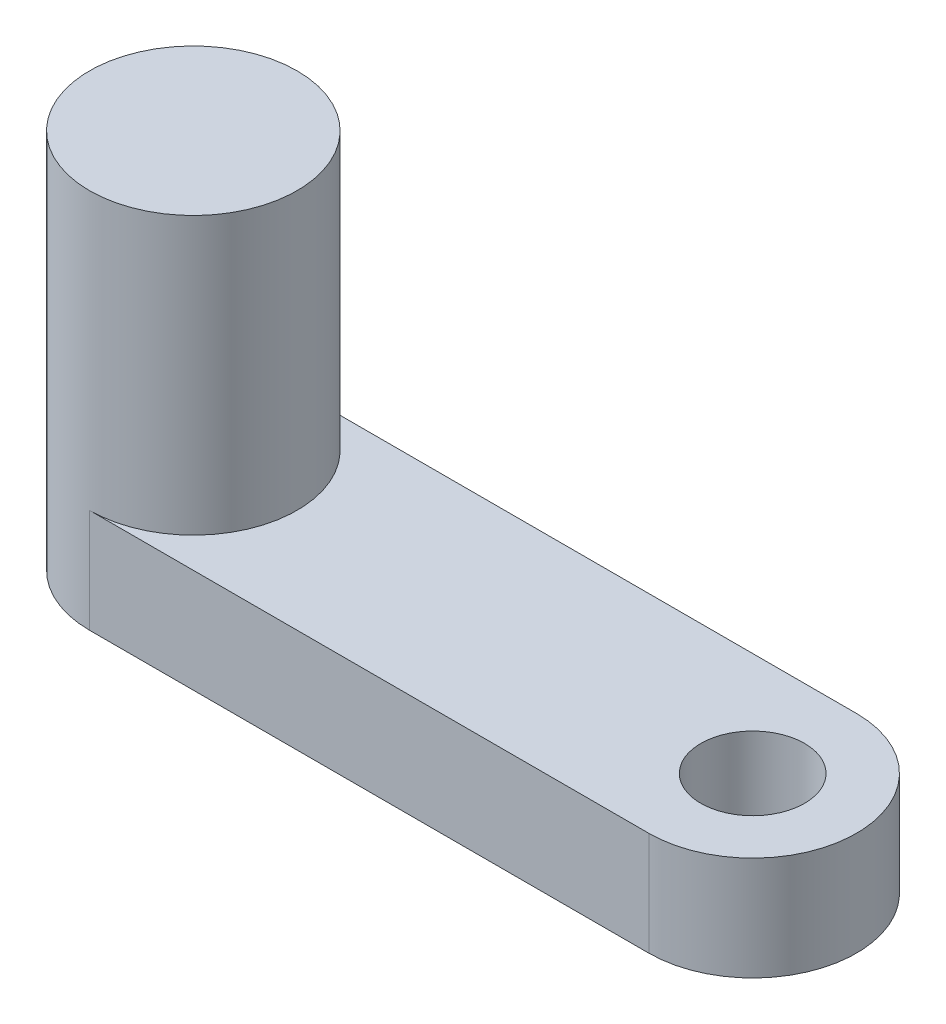
ISO-10303-21;
HEADER;
FILE_DESCRIPTION(('STEP AP214'),'2;1');
FILE_NAME('part.step','',(''),(''),'','','');
FILE_SCHEMA(('AUTOMOTIVE_DESIGN { 1 0 10303 214 1 1 1 1 }'));
ENDSEC;
DATA;
#1=APPLICATION_CONTEXT('core data for automotive mechanical design processes');
#2=APPLICATION_PROTOCOL_DEFINITION('international standard','automotive_design',2000,#1);
#3=PRODUCT_CONTEXT('',#1,'mechanical');
#4=PRODUCT('Part','Part','',(#3));
#5=PRODUCT_RELATED_PRODUCT_CATEGORY('part','',(#4));
#6=PRODUCT_DEFINITION_FORMATION('','',#4);
#7=PRODUCT_DEFINITION_CONTEXT('part definition',#1,'design');
#8=PRODUCT_DEFINITION('design','',#6,#7);
#9=PRODUCT_DEFINITION_SHAPE('','',#8);
#10=(LENGTH_UNIT() NAMED_UNIT(*) SI_UNIT(.MILLI.,.METRE.));
#11=(NAMED_UNIT(*) PLANE_ANGLE_UNIT() SI_UNIT($,.RADIAN.));
#12=(NAMED_UNIT(*) SI_UNIT($,.STERADIAN.) SOLID_ANGLE_UNIT());
#13=UNCERTAINTY_MEASURE_WITH_UNIT(LENGTH_MEASURE(1.E-05),#10,'distance_accuracy_value','');
#14=(GEOMETRIC_REPRESENTATION_CONTEXT(3) GLOBAL_UNCERTAINTY_ASSIGNED_CONTEXT((#13)) GLOBAL_UNIT_ASSIGNED_CONTEXT((#10,
#11,#12)) REPRESENTATION_CONTEXT('',''));
#15=CARTESIAN_POINT('',(0.,0.,0.));
#16=DIRECTION('',(0.,0.,1.));
#17=DIRECTION('',(1.,0.,0.));
#18=AXIS2_PLACEMENT_3D('',#15,#16,#17);
#19=CARTESIAN_POINT('',(0.,9.,0.));
#20=DIRECTION('',(0.,-1.,0.));
#21=DIRECTION('',(0.,0.,-1.));
#22=AXIS2_PLACEMENT_3D('',#19,#20,#21);
#23=CYLINDRICAL_SURFACE('',#22,3.);
#24=CARTESIAN_POINT('',(0.,1.,0.));
#25=DIRECTION('',(0.,-1.,0.));
#26=DIRECTION('',(0.,0.,-1.));
#27=AXIS2_PLACEMENT_3D('',#24,#25,#26);
#28=CIRCLE('',#27,3.);
#29=CARTESIAN_POINT('',(0.,1.,-3.));
#30=VERTEX_POINT('',#29);
#31=CARTESIAN_POINT('',(0.,1.,3.));
#32=VERTEX_POINT('',#31);
#33=EDGE_CURVE('E91',#30,#32,#28,.T.);
#34=ORIENTED_EDGE('',*,*,#33,.F.);
#35=DIRECTION('',(0.,-1.,0.));
#36=VECTOR('',#35,1.);
#37=CARTESIAN_POINT('',(0.,1.,-3.));
#38=LINE('',#37,#36);
#39=CARTESIAN_POINT('',(0.,-2.,-3.));
#40=VERTEX_POINT('',#39);
#41=EDGE_CURVE('E109',#30,#40,#38,.T.);
#42=ORIENTED_EDGE('',*,*,#41,.T.);
#43=CARTESIAN_POINT('',(0.,-2.,0.));
#44=DIRECTION('',(0.,-1.,0.));
#45=DIRECTION('',(0.,0.,-1.));
#46=AXIS2_PLACEMENT_3D('',#43,#44,#45);
#47=CIRCLE('',#46,3.);
#48=CARTESIAN_POINT('',(0.,-2.,3.));
#49=VERTEX_POINT('',#48);
#50=EDGE_CURVE('E51',#49,#40,#47,.T.);
#51=ORIENTED_EDGE('',*,*,#50,.F.);
#52=DIRECTION('',(0.,-1.,0.));
#53=VECTOR('',#52,1.);
#54=CARTESIAN_POINT('',(0.,1.,3.));
#55=LINE('',#54,#53);
#56=EDGE_CURVE('E101',#32,#49,#55,.T.);
#57=ORIENTED_EDGE('',*,*,#56,.F.);
#58=EDGE_LOOP('',(#34,#42,#51,#57));
#59=FACE_BOUND('',#58,.T.);
#60=CARTESIAN_POINT('',(0.,9.,0.));
#61=DIRECTION('',(0.,1.,0.));
#62=DIRECTION('',(0.,0.,1.));
#63=AXIS2_PLACEMENT_3D('',#60,#61,#62);
#64=CIRCLE('',#63,3.);
#65=CARTESIAN_POINT('',(0.,9.,3.));
#66=VERTEX_POINT('',#65);
#67=EDGE_CURVE('E11',#66,#66,#64,.T.);
#68=ORIENTED_EDGE('',*,*,#67,.F.);
#69=EDGE_LOOP('',(#68));
#70=FACE_BOUND('',#69,.T.);
#71=ADVANCED_FACE('F43',(#59,#70),#23,.T.);
#72=CARTESIAN_POINT('',(0.,9.,0.));
#73=DIRECTION('',(0.,1.,0.));
#74=DIRECTION('',(0.,0.,1.));
#75=AXIS2_PLACEMENT_3D('',#72,#73,#74);
#76=PLANE('',#75);
#77=ORIENTED_EDGE('',*,*,#67,.T.);
#78=EDGE_LOOP('',(#77));
#79=FACE_BOUND('',#78,.T.);
#80=ADVANCED_FACE('F160',(#79),#76,.T.);
#81=CARTESIAN_POINT('',(0.,-2.,0.));
#82=DIRECTION('',(0.,-1.,0.));
#83=DIRECTION('',(0.,0.,-1.));
#84=AXIS2_PLACEMENT_3D('',#81,#82,#83);
#85=PLANE('',#84);
#86=CARTESIAN_POINT('',(0.,-2.,0.));
#87=DIRECTION('',(0.,-1.,0.));
#88=DIRECTION('',(0.,0.,-1.));
#89=AXIS2_PLACEMENT_3D('',#86,#87,#88);
#90=CIRCLE('',#89,1.5);
#91=CARTESIAN_POINT('',(0.,-2.,-1.5));
#92=VERTEX_POINT('',#91);
#93=EDGE_CURVE('E141',#92,#92,#90,.T.);
#94=ORIENTED_EDGE('',*,*,#93,.F.);
#95=EDGE_LOOP('',(#94));
#96=FACE_BOUND('',#95,.T.);
#97=ORIENTED_EDGE('',*,*,#50,.T.);
#98=DIRECTION('',(1.,0.,0.));
#99=VECTOR('',#98,1.);
#100=CARTESIAN_POINT('',(0.,-2.,-3.));
#101=LINE('',#100,#99);
#102=CARTESIAN_POINT('',(16.1637239016283,-2.,-3.));
#103=VERTEX_POINT('',#102);
#104=EDGE_CURVE('E120',#40,#103,#101,.T.);
#105=ORIENTED_EDGE('',*,*,#104,.T.);
#106=CARTESIAN_POINT('',(16.1637239016283,-2.,0.));
#107=DIRECTION('',(0.,-1.,0.));
#108=DIRECTION('',(0.,0.,-1.));
#109=AXIS2_PLACEMENT_3D('',#106,#107,#108);
#110=CIRCLE('',#109,3.);
#111=CARTESIAN_POINT('',(16.1637239016283,-2.,3.));
#112=VERTEX_POINT('',#111);
#113=EDGE_CURVE('E126',#112,#103,#110,.F.);
#114=ORIENTED_EDGE('',*,*,#113,.F.);
#115=DIRECTION('',(1.,0.,0.));
#116=VECTOR('',#115,1.);
#117=CARTESIAN_POINT('',(0.,-2.,3.));
#118=LINE('',#117,#116);
#119=EDGE_CURVE('E58',#49,#112,#118,.T.);
#120=ORIENTED_EDGE('',*,*,#119,.F.);
#121=EDGE_LOOP('',(#97,#105,#114,#120));
#122=FACE_BOUND('',#121,.T.);
#123=CARTESIAN_POINT('',(16.1637239016283,-2.,0.));
#124=DIRECTION('',(0.,-1.,0.));
#125=DIRECTION('',(0.,0.,-1.));
#126=AXIS2_PLACEMENT_3D('',#123,#124,#125);
#127=CIRCLE('',#126,1.5);
#128=CARTESIAN_POINT('',(16.1637239016283,-2.,-1.5));
#129=VERTEX_POINT('',#128);
#130=EDGE_CURVE('E129',#129,#129,#127,.T.);
#131=ORIENTED_EDGE('',*,*,#130,.F.);
#132=EDGE_LOOP('',(#131));
#133=FACE_BOUND('',#132,.T.);
#134=ADVANCED_FACE('F157',(#96,#122,#133),#85,.T.);
#135=CARTESIAN_POINT('',(16.1637239016283,1.,0.));
#136=DIRECTION('',(0.,-1.,0.));
#137=DIRECTION('',(0.,0.,-1.));
#138=AXIS2_PLACEMENT_3D('',#135,#136,#137);
#139=CYLINDRICAL_SURFACE('',#138,3.);
#140=ORIENTED_EDGE('',*,*,#113,.T.);
#141=DIRECTION('',(0.,-1.,0.));
#142=VECTOR('',#141,1.);
#143=CARTESIAN_POINT('',(16.1637239016283,1.,-3.));
#144=LINE('',#143,#142);
#145=CARTESIAN_POINT('',(16.1637239016283,1.,-3.));
#146=VERTEX_POINT('',#145);
#147=EDGE_CURVE('E83',#146,#103,#144,.T.);
#148=ORIENTED_EDGE('',*,*,#147,.F.);
#149=CARTESIAN_POINT('',(16.1637239016283,1.,0.));
#150=DIRECTION('',(0.,-1.,0.));
#151=DIRECTION('',(0.,0.,-1.));
#152=AXIS2_PLACEMENT_3D('',#149,#150,#151);
#153=CIRCLE('',#152,3.);
#154=CARTESIAN_POINT('',(16.1637239016283,1.,3.));
#155=VERTEX_POINT('',#154);
#156=EDGE_CURVE('E67',#155,#146,#153,.F.);
#157=ORIENTED_EDGE('',*,*,#156,.F.);
#158=DIRECTION('',(0.,-1.,0.));
#159=VECTOR('',#158,1.);
#160=CARTESIAN_POINT('',(16.1637239016283,1.,3.));
#161=LINE('',#160,#159);
#162=EDGE_CURVE('E104',#155,#112,#161,.T.);
#163=ORIENTED_EDGE('',*,*,#162,.T.);
#164=EDGE_LOOP('',(#140,#148,#157,#163));
#165=FACE_BOUND('',#164,.T.);
#166=ADVANCED_FACE('F159',(#165),#139,.T.);
#167=CARTESIAN_POINT('',(0.,1.,-3.));
#168=DIRECTION('',(0.,0.,-1.));
#169=DIRECTION('',(-1.,0.,0.));
#170=AXIS2_PLACEMENT_3D('',#167,#168,#169);
#171=PLANE('',#170);
#172=ORIENTED_EDGE('',*,*,#104,.F.);
#173=ORIENTED_EDGE('',*,*,#41,.F.);
#174=DIRECTION('',(1.,0.,0.));
#175=VECTOR('',#174,1.);
#176=CARTESIAN_POINT('',(0.,1.,-3.));
#177=LINE('',#176,#175);
#178=EDGE_CURVE('E93',#30,#146,#177,.T.);
#179=ORIENTED_EDGE('',*,*,#178,.T.);
#180=ORIENTED_EDGE('',*,*,#147,.T.);
#181=EDGE_LOOP('',(#172,#173,#179,#180));
#182=FACE_BOUND('',#181,.T.);
#183=ADVANCED_FACE('F167',(#182),#171,.T.);
#184=CARTESIAN_POINT('',(16.1637239016283,1.,0.));
#185=DIRECTION('',(0.,-1.,0.));
#186=DIRECTION('',(0.,0.,-1.));
#187=AXIS2_PLACEMENT_3D('',#184,#185,#186);
#188=CYLINDRICAL_SURFACE('',#187,1.5);
#189=CARTESIAN_POINT('',(16.1637239016283,1.,0.));
#190=DIRECTION('',(0.,-1.,0.));
#191=DIRECTION('',(0.,0.,-1.));
#192=AXIS2_PLACEMENT_3D('',#189,#190,#191);
#193=CIRCLE('',#192,1.5);
#194=CARTESIAN_POINT('',(16.1637239016283,1.,-1.5));
#195=VERTEX_POINT('',#194);
#196=EDGE_CURVE('E123',#195,#195,#193,.T.);
#197=ORIENTED_EDGE('',*,*,#196,.F.);
#198=EDGE_LOOP('',(#197));
#199=FACE_BOUND('',#198,.T.);
#200=ORIENTED_EDGE('',*,*,#130,.T.);
#201=EDGE_LOOP('',(#200));
#202=FACE_BOUND('',#201,.T.);
#203=ADVANCED_FACE('F165',(#199,#202),#188,.F.);
#204=CARTESIAN_POINT('',(0.,1.,3.));
#205=DIRECTION('',(0.,0.,-1.));
#206=DIRECTION('',(-1.,0.,0.));
#207=AXIS2_PLACEMENT_3D('',#204,#205,#206);
#208=PLANE('',#207);
#209=ORIENTED_EDGE('',*,*,#119,.T.);
#210=ORIENTED_EDGE('',*,*,#162,.F.);
#211=DIRECTION('',(1.,0.,0.));
#212=VECTOR('',#211,1.);
#213=CARTESIAN_POINT('',(0.,1.,3.));
#214=LINE('',#213,#212);
#215=EDGE_CURVE('E88',#32,#155,#214,.T.);
#216=ORIENTED_EDGE('',*,*,#215,.F.);
#217=ORIENTED_EDGE('',*,*,#56,.T.);
#218=EDGE_LOOP('',(#209,#210,#216,#217));
#219=FACE_BOUND('',#218,.T.);
#220=ADVANCED_FACE('F100',(#219),#208,.F.);
#221=CARTESIAN_POINT('',(0.,1.,0.));
#222=DIRECTION('',(0.,-1.,0.));
#223=DIRECTION('',(0.,0.,-1.));
#224=AXIS2_PLACEMENT_3D('',#221,#222,#223);
#225=PLANE('',#224);
#226=ORIENTED_EDGE('',*,*,#196,.T.);
#227=EDGE_LOOP('',(#226));
#228=FACE_BOUND('',#227,.T.);
#229=ORIENTED_EDGE('',*,*,#156,.T.);
#230=ORIENTED_EDGE('',*,*,#178,.F.);
#231=ORIENTED_EDGE('',*,*,#33,.T.);
#232=ORIENTED_EDGE('',*,*,#215,.T.);
#233=EDGE_LOOP('',(#229,#230,#231,#232));
#234=FACE_BOUND('',#233,.T.);
#235=ADVANCED_FACE('F92',(#228,#234),#225,.F.);
#236=CARTESIAN_POINT('',(0.,8.,0.));
#237=DIRECTION('',(0.,-1.,0.));
#238=DIRECTION('',(0.,0.,-1.));
#239=AXIS2_PLACEMENT_3D('',#236,#237,#238);
#240=CYLINDRICAL_SURFACE('',#239,1.5);
#241=CARTESIAN_POINT('',(0.,8.,0.));
#242=DIRECTION('',(0.,-1.,0.));
#243=DIRECTION('',(0.,0.,-1.));
#244=AXIS2_PLACEMENT_3D('',#241,#242,#243);
#245=CIRCLE('',#244,1.5);
#246=CARTESIAN_POINT('',(0.,8.,-1.5));
#247=VERTEX_POINT('',#246);
#248=EDGE_CURVE('E133',#247,#247,#245,.T.);
#249=ORIENTED_EDGE('',*,*,#248,.F.);
#250=EDGE_LOOP('',(#249));
#251=FACE_BOUND('',#250,.T.);
#252=ORIENTED_EDGE('',*,*,#93,.T.);
#253=EDGE_LOOP('',(#252));
#254=FACE_BOUND('',#253,.T.);
#255=ADVANCED_FACE('F151',(#251,#254),#240,.F.);
#256=CARTESIAN_POINT('',(0.,8.,0.));
#257=DIRECTION('',(0.,-1.,0.));
#258=DIRECTION('',(0.,0.,-1.));
#259=AXIS2_PLACEMENT_3D('',#256,#257,#258);
#260=PLANE('',#259);
#261=ORIENTED_EDGE('',*,*,#248,.T.);
#262=EDGE_LOOP('',(#261));
#263=FACE_BOUND('',#262,.T.);
#264=ADVANCED_FACE('F149',(#263),#260,.T.);
#265=CLOSED_SHELL('',(#71,#80,#134,#166,#183,#203,#220,#235,#255,#264));
#266=MANIFOLD_SOLID_BREP('B2',#265);
#267=ADVANCED_BREP_SHAPE_REPRESENTATION('',(#18,#266),#14);
#268=SHAPE_DEFINITION_REPRESENTATION(#9,#267);
ENDSEC;
END-ISO-10303-21;
